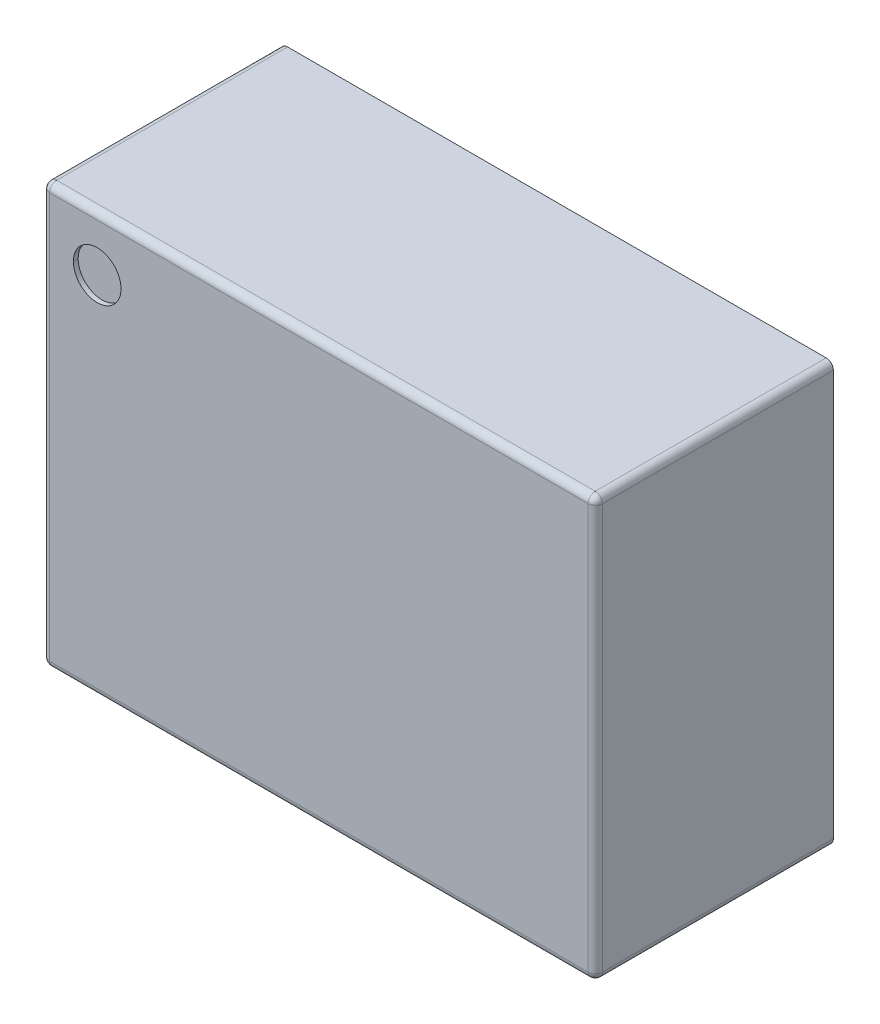
ISO-10303-21;
HEADER;
FILE_DESCRIPTION(('STEP AP214'),'2;1');
FILE_NAME('part.step','',(''),(''),'','','');
FILE_SCHEMA(('AUTOMOTIVE_DESIGN { 1 0 10303 214 1 1 1 1 }'));
ENDSEC;
DATA;
#1=APPLICATION_CONTEXT('core data for automotive mechanical design processes');
#2=APPLICATION_PROTOCOL_DEFINITION('international standard','automotive_design',2000,#1);
#3=PRODUCT_CONTEXT('',#1,'mechanical');
#4=PRODUCT('Part','Part','',(#3));
#5=PRODUCT_RELATED_PRODUCT_CATEGORY('part','',(#4));
#6=PRODUCT_DEFINITION_FORMATION('','',#4);
#7=PRODUCT_DEFINITION_CONTEXT('part definition',#1,'design');
#8=PRODUCT_DEFINITION('design','',#6,#7);
#9=PRODUCT_DEFINITION_SHAPE('','',#8);
#10=(LENGTH_UNIT() NAMED_UNIT(*) SI_UNIT(.MILLI.,.METRE.));
#11=(NAMED_UNIT(*) PLANE_ANGLE_UNIT() SI_UNIT($,.RADIAN.));
#12=(NAMED_UNIT(*) SI_UNIT($,.STERADIAN.) SOLID_ANGLE_UNIT());
#13=UNCERTAINTY_MEASURE_WITH_UNIT(LENGTH_MEASURE(1.E-05),#10,'distance_accuracy_value','');
#14=(GEOMETRIC_REPRESENTATION_CONTEXT(3) GLOBAL_UNCERTAINTY_ASSIGNED_CONTEXT((#13)) GLOBAL_UNIT_ASSIGNED_CONTEXT((#10,
#11,#12)) REPRESENTATION_CONTEXT('',''));
#15=CARTESIAN_POINT('',(0.,0.,0.));
#16=DIRECTION('',(0.,0.,1.));
#17=DIRECTION('',(1.,0.,0.));
#18=AXIS2_PLACEMENT_3D('',#15,#16,#17);
#19=CARTESIAN_POINT('',(-0.4655,0.326,0.68));
#20=DIRECTION('',(0.,0.,1.));
#21=DIRECTION('',(1.,0.,0.));
#22=AXIS2_PLACEMENT_3D('',#19,#20,#21);
#23=CYLINDRICAL_SURFACE('',#22,0.0500000000000001);
#24=CARTESIAN_POINT('',(-0.4655,0.326,0.68));
#25=DIRECTION('',(0.,0.,1.));
#26=DIRECTION('',(1.,0.,0.));
#27=AXIS2_PLACEMENT_3D('',#24,#25,#26);
#28=CIRCLE('',#27,0.0500000000000001);
#29=CARTESIAN_POINT('',(-0.5155,0.326,0.68));
#30=VERTEX_POINT('',#29);
#31=CARTESIAN_POINT('',(-0.4155,0.326,0.68));
#32=VERTEX_POINT('',#31);
#33=EDGE_CURVE('E11',#30,#32,#28,.T.);
#34=ORIENTED_EDGE('',*,*,#33,.F.);
#35=DIRECTION('',(0.,0.,1.));
#36=VECTOR('',#35,1.);
#37=CARTESIAN_POINT('',(-0.5155,0.326,0.68));
#38=LINE('',#37,#36);
#39=CARTESIAN_POINT('',(-0.5155,0.326,0.69));
#40=VERTEX_POINT('',#39);
#41=EDGE_CURVE('E24',#30,#40,#38,.T.);
#42=ORIENTED_EDGE('',*,*,#41,.T.);
#43=CARTESIAN_POINT('',(-0.4655,0.326,0.69));
#44=DIRECTION('',(0.,0.,1.));
#45=DIRECTION('',(1.,0.,0.));
#46=AXIS2_PLACEMENT_3D('',#43,#44,#45);
#47=CIRCLE('',#46,0.0500000000000001);
#48=CARTESIAN_POINT('',(-0.4155,0.326,0.69));
#49=VERTEX_POINT('',#48);
#50=EDGE_CURVE('E206',#40,#49,#47,.T.);
#51=ORIENTED_EDGE('',*,*,#50,.T.);
#52=DIRECTION('',(0.,0.,1.));
#53=VECTOR('',#52,1.);
#54=CARTESIAN_POINT('',(-0.4155,0.326,0.68));
#55=LINE('',#54,#53);
#56=EDGE_CURVE('E37',#32,#49,#55,.T.);
#57=ORIENTED_EDGE('',*,*,#56,.F.);
#58=EDGE_LOOP('',(#34,#42,#51,#57));
#59=FACE_BOUND('',#58,.T.);
#60=ADVANCED_FACE('F17',(#59),#23,.F.);
#61=CARTESIAN_POINT('',(0.5805,0.441,0.69));
#62=DIRECTION('',(-1.,0.,0.));
#63=DIRECTION('',(0.,0.,1.));
#64=AXIS2_PLACEMENT_3D('',#61,#62,#63);
#65=PLANE('',#64);
#66=DIRECTION('',(0.,1.,0.));
#67=VECTOR('',#66,1.);
#68=CARTESIAN_POINT('',(0.5805,0.441,0.19));
#69=LINE('',#68,#67);
#70=CARTESIAN_POINT('',(0.5805,-0.426,0.19));
#71=VERTEX_POINT('',#70);
#72=CARTESIAN_POINT('',(0.5805,0.426,0.19));
#73=VERTEX_POINT('',#72);
#74=EDGE_CURVE('E203',#71,#73,#69,.T.);
#75=ORIENTED_EDGE('',*,*,#74,.T.);
#76=DIRECTION('',(0.,0.,1.));
#77=VECTOR('',#76,1.);
#78=CARTESIAN_POINT('',(0.5805,0.426,0.69));
#79=LINE('',#78,#77);
#80=CARTESIAN_POINT('',(0.5805,0.426,0.675));
#81=VERTEX_POINT('',#80);
#82=EDGE_CURVE('E201',#73,#81,#79,.T.);
#83=ORIENTED_EDGE('',*,*,#82,.T.);
#84=DIRECTION('',(0.,-1.,0.));
#85=VECTOR('',#84,1.);
#86=CARTESIAN_POINT('',(0.5805,-0.441,0.675));
#87=LINE('',#86,#85);
#88=CARTESIAN_POINT('',(0.5805,-0.426,0.675));
#89=VERTEX_POINT('',#88);
#90=EDGE_CURVE('E139',#81,#89,#87,.T.);
#91=ORIENTED_EDGE('',*,*,#90,.T.);
#92=DIRECTION('',(0.,0.,-1.));
#93=VECTOR('',#92,1.);
#94=CARTESIAN_POINT('',(0.5805,-0.426,0.69));
#95=LINE('',#94,#93);
#96=EDGE_CURVE('E197',#89,#71,#95,.T.);
#97=ORIENTED_EDGE('',*,*,#96,.T.);
#98=EDGE_LOOP('',(#75,#83,#91,#97));
#99=FACE_BOUND('',#98,.T.);
#100=ADVANCED_FACE('F227',(#99),#65,.F.);
#101=CARTESIAN_POINT('',(-0.5805,0.441,0.69));
#102=DIRECTION('',(0.,-1.,0.));
#103=DIRECTION('',(0.,0.,-1.));
#104=AXIS2_PLACEMENT_3D('',#101,#102,#103);
#105=PLANE('',#104);
#106=DIRECTION('',(-1.,0.,0.));
#107=VECTOR('',#106,1.);
#108=CARTESIAN_POINT('',(-0.5805,0.441,0.19));
#109=LINE('',#108,#107);
#110=CARTESIAN_POINT('',(0.5655,0.441,0.19));
#111=VERTEX_POINT('',#110);
#112=CARTESIAN_POINT('',(-0.5655,0.441,0.19));
#113=VERTEX_POINT('',#112);
#114=EDGE_CURVE('E195',#111,#113,#109,.T.);
#115=ORIENTED_EDGE('',*,*,#114,.T.);
#116=DIRECTION('',(0.,0.,1.));
#117=VECTOR('',#116,1.);
#118=CARTESIAN_POINT('',(-0.5655,0.441,0.69));
#119=LINE('',#118,#117);
#120=CARTESIAN_POINT('',(-0.5655,0.441,0.675));
#121=VERTEX_POINT('',#120);
#122=EDGE_CURVE('E193',#113,#121,#119,.T.);
#123=ORIENTED_EDGE('',*,*,#122,.T.);
#124=DIRECTION('',(1.,0.,0.));
#125=VECTOR('',#124,1.);
#126=CARTESIAN_POINT('',(0.5805,0.441,0.675));
#127=LINE('',#126,#125);
#128=CARTESIAN_POINT('',(0.5655,0.441,0.675));
#129=VERTEX_POINT('',#128);
#130=EDGE_CURVE('E191',#121,#129,#127,.T.);
#131=ORIENTED_EDGE('',*,*,#130,.T.);
#132=DIRECTION('',(0.,0.,-1.));
#133=VECTOR('',#132,1.);
#134=CARTESIAN_POINT('',(0.5655,0.441,0.69));
#135=LINE('',#134,#133);
#136=EDGE_CURVE('E188',#129,#111,#135,.T.);
#137=ORIENTED_EDGE('',*,*,#136,.T.);
#138=EDGE_LOOP('',(#115,#123,#131,#137));
#139=FACE_BOUND('',#138,.T.);
#140=ADVANCED_FACE('F231',(#139),#105,.F.);
#141=CARTESIAN_POINT('',(-0.5805,0.441,0.69));
#142=DIRECTION('',(1.,0.,0.));
#143=DIRECTION('',(0.,0.,-1.));
#144=AXIS2_PLACEMENT_3D('',#141,#142,#143);
#145=PLANE('',#144);
#146=DIRECTION('',(0.,1.,0.));
#147=VECTOR('',#146,1.);
#148=CARTESIAN_POINT('',(-0.5805,0.441,0.675));
#149=LINE('',#148,#147);
#150=CARTESIAN_POINT('',(-0.5805,-0.426,0.675));
#151=VERTEX_POINT('',#150);
#152=CARTESIAN_POINT('',(-0.5805,0.426,0.675));
#153=VERTEX_POINT('',#152);
#154=EDGE_CURVE('E186',#151,#153,#149,.T.);
#155=ORIENTED_EDGE('',*,*,#154,.T.);
#156=DIRECTION('',(0.,0.,-1.));
#157=VECTOR('',#156,1.);
#158=CARTESIAN_POINT('',(-0.5805,0.426,0.69));
#159=LINE('',#158,#157);
#160=CARTESIAN_POINT('',(-0.5805,0.426,0.19));
#161=VERTEX_POINT('',#160);
#162=EDGE_CURVE('E184',#153,#161,#159,.T.);
#163=ORIENTED_EDGE('',*,*,#162,.T.);
#164=DIRECTION('',(0.,-1.,0.));
#165=VECTOR('',#164,1.);
#166=CARTESIAN_POINT('',(-0.5805,0.441,0.19));
#167=LINE('',#166,#165);
#168=CARTESIAN_POINT('',(-0.5805,-0.426,0.19));
#169=VERTEX_POINT('',#168);
#170=EDGE_CURVE('E182',#161,#169,#167,.T.);
#171=ORIENTED_EDGE('',*,*,#170,.T.);
#172=DIRECTION('',(0.,0.,1.));
#173=VECTOR('',#172,1.);
#174=CARTESIAN_POINT('',(-0.5805,-0.426,0.69));
#175=LINE('',#174,#173);
#176=EDGE_CURVE('E179',#169,#151,#175,.T.);
#177=ORIENTED_EDGE('',*,*,#176,.T.);
#178=EDGE_LOOP('',(#155,#163,#171,#177));
#179=FACE_BOUND('',#178,.T.);
#180=ADVANCED_FACE('F223',(#179),#145,.F.);
#181=CARTESIAN_POINT('',(-0.5805,-0.441,0.69));
#182=DIRECTION('',(0.,1.,0.));
#183=DIRECTION('',(0.,0.,1.));
#184=AXIS2_PLACEMENT_3D('',#181,#182,#183);
#185=PLANE('',#184);
#186=DIRECTION('',(1.,0.,0.));
#187=VECTOR('',#186,1.);
#188=CARTESIAN_POINT('',(-0.5805,-0.441,0.19));
#189=LINE('',#188,#187);
#190=CARTESIAN_POINT('',(-0.5655,-0.441,0.19));
#191=VERTEX_POINT('',#190);
#192=CARTESIAN_POINT('',(0.5655,-0.441,0.19));
#193=VERTEX_POINT('',#192);
#194=EDGE_CURVE('E177',#191,#193,#189,.T.);
#195=ORIENTED_EDGE('',*,*,#194,.T.);
#196=DIRECTION('',(0.,0.,1.));
#197=VECTOR('',#196,1.);
#198=CARTESIAN_POINT('',(0.5655,-0.441,0.69));
#199=LINE('',#198,#197);
#200=CARTESIAN_POINT('',(0.5655,-0.441,0.675));
#201=VERTEX_POINT('',#200);
#202=EDGE_CURVE('E175',#193,#201,#199,.T.);
#203=ORIENTED_EDGE('',*,*,#202,.T.);
#204=DIRECTION('',(-1.,0.,0.));
#205=VECTOR('',#204,1.);
#206=CARTESIAN_POINT('',(-0.5805,-0.441,0.675));
#207=LINE('',#206,#205);
#208=CARTESIAN_POINT('',(-0.5655,-0.441,0.675));
#209=VERTEX_POINT('',#208);
#210=EDGE_CURVE('E173',#201,#209,#207,.T.);
#211=ORIENTED_EDGE('',*,*,#210,.T.);
#212=DIRECTION('',(0.,0.,-1.));
#213=VECTOR('',#212,1.);
#214=CARTESIAN_POINT('',(-0.5655,-0.441,0.69));
#215=LINE('',#214,#213);
#216=EDGE_CURVE('E170',#209,#191,#215,.T.);
#217=ORIENTED_EDGE('',*,*,#216,.T.);
#218=EDGE_LOOP('',(#195,#203,#211,#217));
#219=FACE_BOUND('',#218,.T.);
#220=ADVANCED_FACE('F213',(#219),#185,.F.);
#221=CARTESIAN_POINT('',(0.,0.,0.69));
#222=DIRECTION('',(0.,0.,1.));
#223=DIRECTION('',(1.,0.,0.));
#224=AXIS2_PLACEMENT_3D('',#221,#222,#223);
#225=PLANE('',#224);
#226=CARTESIAN_POINT('',(-0.4655,0.326,0.69));
#227=DIRECTION('',(0.,0.,1.));
#228=DIRECTION('',(1.,0.,0.));
#229=AXIS2_PLACEMENT_3D('',#226,#227,#228);
#230=CIRCLE('',#229,0.0500000000000001);
#231=EDGE_CURVE('E168',#49,#40,#230,.T.);
#232=ORIENTED_EDGE('',*,*,#231,.F.);
#233=ORIENTED_EDGE('',*,*,#50,.F.);
#234=EDGE_LOOP('',(#232,#233));
#235=FACE_BOUND('',#234,.T.);
#236=DIRECTION('',(0.,-1.,0.));
#237=VECTOR('',#236,1.);
#238=CARTESIAN_POINT('',(-0.5655,-0.441,0.69));
#239=LINE('',#238,#237);
#240=CARTESIAN_POINT('',(-0.5655,0.426,0.69));
#241=VERTEX_POINT('',#240);
#242=CARTESIAN_POINT('',(-0.5655,-0.426,0.69));
#243=VERTEX_POINT('',#242);
#244=EDGE_CURVE('E166',#241,#243,#239,.T.);
#245=ORIENTED_EDGE('',*,*,#244,.T.);
#246=DIRECTION('',(1.,0.,0.));
#247=VECTOR('',#246,1.);
#248=CARTESIAN_POINT('',(0.5805,-0.426,0.69));
#249=LINE('',#248,#247);
#250=CARTESIAN_POINT('',(0.5655,-0.426,0.69));
#251=VERTEX_POINT('',#250);
#252=EDGE_CURVE('E111',#243,#251,#249,.T.);
#253=ORIENTED_EDGE('',*,*,#252,.T.);
#254=DIRECTION('',(0.,1.,0.));
#255=VECTOR('',#254,1.);
#256=CARTESIAN_POINT('',(0.5655,0.441,0.69));
#257=LINE('',#256,#255);
#258=CARTESIAN_POINT('',(0.5655,0.426,0.69));
#259=VERTEX_POINT('',#258);
#260=EDGE_CURVE('E105',#251,#259,#257,.T.);
#261=ORIENTED_EDGE('',*,*,#260,.T.);
#262=DIRECTION('',(-1.,0.,0.));
#263=VECTOR('',#262,1.);
#264=CARTESIAN_POINT('',(-0.5805,0.426,0.69));
#265=LINE('',#264,#263);
#266=EDGE_CURVE('E108',#259,#241,#265,.T.);
#267=ORIENTED_EDGE('',*,*,#266,.T.);
#268=EDGE_LOOP('',(#245,#253,#261,#267));
#269=FACE_BOUND('',#268,.T.);
#270=ADVANCED_FACE('F107',(#235,#269),#225,.T.);
#271=CARTESIAN_POINT('',(0.,0.,0.19));
#272=DIRECTION('',(0.,0.,1.));
#273=DIRECTION('',(1.,0.,0.));
#274=AXIS2_PLACEMENT_3D('',#271,#272,#273);
#275=PLANE('',#274);
#276=ORIENTED_EDGE('',*,*,#170,.F.);
#277=CARTESIAN_POINT('',(-0.5655,0.426,0.19));
#278=DIRECTION('',(0.,0.,-1.));
#279=DIRECTION('',(1.,0.,0.));
#280=AXIS2_PLACEMENT_3D('',#277,#278,#279);
#281=CIRCLE('',#280,0.015);
#282=EDGE_CURVE('E127',#161,#113,#281,.T.);
#283=ORIENTED_EDGE('',*,*,#282,.T.);
#284=ORIENTED_EDGE('',*,*,#114,.F.);
#285=CARTESIAN_POINT('',(0.5655,0.426,0.19));
#286=DIRECTION('',(0.,0.,-1.));
#287=DIRECTION('',(1.,0.,0.));
#288=AXIS2_PLACEMENT_3D('',#285,#286,#287);
#289=CIRCLE('',#288,0.015);
#290=EDGE_CURVE('E160',#111,#73,#289,.T.);
#291=ORIENTED_EDGE('',*,*,#290,.T.);
#292=ORIENTED_EDGE('',*,*,#74,.F.);
#293=CARTESIAN_POINT('',(0.5655,-0.426,0.19));
#294=DIRECTION('',(0.,0.,-1.));
#295=DIRECTION('',(1.,0.,0.));
#296=AXIS2_PLACEMENT_3D('',#293,#294,#295);
#297=CIRCLE('',#296,0.015);
#298=EDGE_CURVE('E157',#71,#193,#297,.T.);
#299=ORIENTED_EDGE('',*,*,#298,.T.);
#300=ORIENTED_EDGE('',*,*,#194,.F.);
#301=CARTESIAN_POINT('',(-0.5655,-0.426,0.19));
#302=DIRECTION('',(0.,0.,-1.));
#303=DIRECTION('',(1.,0.,0.));
#304=AXIS2_PLACEMENT_3D('',#301,#302,#303);
#305=CIRCLE('',#304,0.015);
#306=EDGE_CURVE('E154',#191,#169,#305,.T.);
#307=ORIENTED_EDGE('',*,*,#306,.T.);
#308=EDGE_LOOP('',(#276,#283,#284,#291,#292,#299,#300,#307));
#309=FACE_BOUND('',#308,.T.);
#310=ADVANCED_FACE('F212',(#309),#275,.F.);
#311=CARTESIAN_POINT('',(-0.5655,0.426,0.69));
#312=DIRECTION('',(0.,0.,-1.));
#313=DIRECTION('',(-1.,0.,0.));
#314=AXIS2_PLACEMENT_3D('',#311,#312,#313);
#315=CYLINDRICAL_SURFACE('',#314,0.015);
#316=ORIENTED_EDGE('',*,*,#282,.F.);
#317=ORIENTED_EDGE('',*,*,#162,.F.);
#318=CARTESIAN_POINT('',(-0.5655,0.426,0.675));
#319=DIRECTION('',(0.,0.,1.));
#320=DIRECTION('',(1.,0.,0.));
#321=AXIS2_PLACEMENT_3D('',#318,#319,#320);
#322=CIRCLE('',#321,0.015);
#323=EDGE_CURVE('E135',#121,#153,#322,.T.);
#324=ORIENTED_EDGE('',*,*,#323,.F.);
#325=ORIENTED_EDGE('',*,*,#122,.F.);
#326=EDGE_LOOP('',(#316,#317,#324,#325));
#327=FACE_BOUND('',#326,.T.);
#328=ADVANCED_FACE('F220',(#327),#315,.T.);
#329=CARTESIAN_POINT('',(0.,0.426,0.675));
#330=DIRECTION('',(1.,0.,0.));
#331=DIRECTION('',(0.,0.,-1.));
#332=AXIS2_PLACEMENT_3D('',#329,#330,#331);
#333=CYLINDRICAL_SURFACE('',#332,0.015);
#334=CARTESIAN_POINT('',(0.5655,0.426,0.675));
#335=DIRECTION('',(1.,0.,0.));
#336=DIRECTION('',(0.,0.,-1.));
#337=AXIS2_PLACEMENT_3D('',#334,#335,#336);
#338=CIRCLE('',#337,0.015);
#339=EDGE_CURVE('E122',#129,#259,#338,.T.);
#340=ORIENTED_EDGE('',*,*,#339,.F.);
#341=ORIENTED_EDGE('',*,*,#130,.F.);
#342=CARTESIAN_POINT('',(-0.5655,0.426,0.675));
#343=DIRECTION('',(-1.,0.,0.));
#344=DIRECTION('',(0.,0.,1.));
#345=AXIS2_PLACEMENT_3D('',#342,#343,#344);
#346=CIRCLE('',#345,0.015);
#347=EDGE_CURVE('E125',#241,#121,#346,.T.);
#348=ORIENTED_EDGE('',*,*,#347,.F.);
#349=ORIENTED_EDGE('',*,*,#266,.F.);
#350=EDGE_LOOP('',(#340,#341,#348,#349));
#351=FACE_BOUND('',#350,.T.);
#352=ADVANCED_FACE('F120',(#351),#333,.T.);
#353=CARTESIAN_POINT('',(0.5655,0.426,0.69));
#354=DIRECTION('',(0.,0.,-1.));
#355=DIRECTION('',(-1.,0.,0.));
#356=AXIS2_PLACEMENT_3D('',#353,#354,#355);
#357=CYLINDRICAL_SURFACE('',#356,0.015);
#358=ORIENTED_EDGE('',*,*,#290,.F.);
#359=ORIENTED_EDGE('',*,*,#136,.F.);
#360=CARTESIAN_POINT('',(0.5655,0.426,0.675));
#361=DIRECTION('',(0.,0.,1.));
#362=DIRECTION('',(1.,0.,0.));
#363=AXIS2_PLACEMENT_3D('',#360,#361,#362);
#364=CIRCLE('',#363,0.015);
#365=EDGE_CURVE('E134',#81,#129,#364,.T.);
#366=ORIENTED_EDGE('',*,*,#365,.F.);
#367=ORIENTED_EDGE('',*,*,#82,.F.);
#368=EDGE_LOOP('',(#358,#359,#366,#367));
#369=FACE_BOUND('',#368,.T.);
#370=ADVANCED_FACE('F313',(#369),#357,.T.);
#371=CARTESIAN_POINT('',(-0.5655,0.426,0.675));
#372=DIRECTION('',(0.,1.,0.));
#373=DIRECTION('',(1.,0.,0.));
#374=AXIS2_PLACEMENT_3D('',#371,#372,#373);
#375=SPHERICAL_SURFACE('',#374,0.015);
#376=ORIENTED_EDGE('',*,*,#347,.T.);
#377=ORIENTED_EDGE('',*,*,#323,.T.);
#378=CARTESIAN_POINT('',(-0.5655,0.426,0.675));
#379=DIRECTION('',(0.,-1.,0.));
#380=DIRECTION('',(0.,0.,1.));
#381=AXIS2_PLACEMENT_3D('',#378,#379,#380);
#382=CIRCLE('',#381,0.015);
#383=EDGE_CURVE('E140',#241,#153,#382,.T.);
#384=ORIENTED_EDGE('',*,*,#383,.F.);
#385=EDGE_LOOP('',(#376,#377,#384));
#386=FACE_BOUND('',#385,.T.);
#387=ADVANCED_FACE('F254',(#386),#375,.T.);
#388=CARTESIAN_POINT('',(0.5655,0.426,0.675));
#389=DIRECTION('',(0.,1.,0.));
#390=DIRECTION('',(1.,0.,0.));
#391=AXIS2_PLACEMENT_3D('',#388,#389,#390);
#392=SPHERICAL_SURFACE('',#391,0.015);
#393=ORIENTED_EDGE('',*,*,#365,.T.);
#394=ORIENTED_EDGE('',*,*,#339,.T.);
#395=CARTESIAN_POINT('',(0.5655,0.426,0.675));
#396=DIRECTION('',(0.,-1.,0.));
#397=DIRECTION('',(0.,0.,1.));
#398=AXIS2_PLACEMENT_3D('',#395,#396,#397);
#399=CIRCLE('',#398,0.015);
#400=EDGE_CURVE('E132',#81,#259,#399,.T.);
#401=ORIENTED_EDGE('',*,*,#400,.F.);
#402=EDGE_LOOP('',(#393,#394,#401));
#403=FACE_BOUND('',#402,.T.);
#404=ADVANCED_FACE('F131',(#403),#392,.T.);
#405=CARTESIAN_POINT('',(-0.5655,-0.426,0.69));
#406=DIRECTION('',(0.,0.,-1.));
#407=DIRECTION('',(-1.,0.,0.));
#408=AXIS2_PLACEMENT_3D('',#405,#406,#407);
#409=CYLINDRICAL_SURFACE('',#408,0.015);
#410=ORIENTED_EDGE('',*,*,#306,.F.);
#411=ORIENTED_EDGE('',*,*,#216,.F.);
#412=CARTESIAN_POINT('',(-0.5655,-0.426,0.675));
#413=DIRECTION('',(0.,0.,1.));
#414=DIRECTION('',(1.,0.,0.));
#415=AXIS2_PLACEMENT_3D('',#412,#413,#414);
#416=CIRCLE('',#415,0.015);
#417=EDGE_CURVE('E141',#151,#209,#416,.T.);
#418=ORIENTED_EDGE('',*,*,#417,.F.);
#419=ORIENTED_EDGE('',*,*,#176,.F.);
#420=EDGE_LOOP('',(#410,#411,#418,#419));
#421=FACE_BOUND('',#420,.T.);
#422=ADVANCED_FACE('F282',(#421),#409,.T.);
#423=CARTESIAN_POINT('',(-0.5655,0.,0.675));
#424=DIRECTION('',(0.,1.,0.));
#425=DIRECTION('',(0.,0.,1.));
#426=AXIS2_PLACEMENT_3D('',#423,#424,#425);
#427=CYLINDRICAL_SURFACE('',#426,0.015);
#428=ORIENTED_EDGE('',*,*,#383,.T.);
#429=ORIENTED_EDGE('',*,*,#154,.F.);
#430=CARTESIAN_POINT('',(-0.5655,-0.426,0.675));
#431=DIRECTION('',(0.,-1.,0.));
#432=DIRECTION('',(0.,0.,-1.));
#433=AXIS2_PLACEMENT_3D('',#430,#431,#432);
#434=CIRCLE('',#433,0.015);
#435=EDGE_CURVE('E146',#243,#151,#434,.T.);
#436=ORIENTED_EDGE('',*,*,#435,.F.);
#437=ORIENTED_EDGE('',*,*,#244,.F.);
#438=EDGE_LOOP('',(#428,#429,#436,#437));
#439=FACE_BOUND('',#438,.T.);
#440=ADVANCED_FACE('F255',(#439),#427,.T.);
#441=CARTESIAN_POINT('',(0.5655,0.,0.675));
#442=DIRECTION('',(0.,-1.,0.));
#443=DIRECTION('',(0.,0.,-1.));
#444=AXIS2_PLACEMENT_3D('',#441,#442,#443);
#445=CYLINDRICAL_SURFACE('',#444,0.015);
#446=ORIENTED_EDGE('',*,*,#400,.T.);
#447=ORIENTED_EDGE('',*,*,#260,.F.);
#448=CARTESIAN_POINT('',(0.5655,-0.426,0.675));
#449=DIRECTION('',(0.,-1.,0.));
#450=DIRECTION('',(0.,0.,-1.));
#451=AXIS2_PLACEMENT_3D('',#448,#449,#450);
#452=CIRCLE('',#451,0.015);
#453=EDGE_CURVE('E276',#89,#251,#452,.T.);
#454=ORIENTED_EDGE('',*,*,#453,.F.);
#455=ORIENTED_EDGE('',*,*,#90,.F.);
#456=EDGE_LOOP('',(#446,#447,#454,#455));
#457=FACE_BOUND('',#456,.T.);
#458=ADVANCED_FACE('F138',(#457),#445,.T.);
#459=CARTESIAN_POINT('',(0.5655,-0.426,0.69));
#460=DIRECTION('',(0.,0.,-1.));
#461=DIRECTION('',(-1.,0.,0.));
#462=AXIS2_PLACEMENT_3D('',#459,#460,#461);
#463=CYLINDRICAL_SURFACE('',#462,0.015);
#464=ORIENTED_EDGE('',*,*,#298,.F.);
#465=ORIENTED_EDGE('',*,*,#96,.F.);
#466=CARTESIAN_POINT('',(0.5655,-0.426,0.675));
#467=DIRECTION('',(0.,0.,1.));
#468=DIRECTION('',(1.,0.,0.));
#469=AXIS2_PLACEMENT_3D('',#466,#467,#468);
#470=CIRCLE('',#469,0.015);
#471=EDGE_CURVE('E271',#201,#89,#470,.T.);
#472=ORIENTED_EDGE('',*,*,#471,.F.);
#473=ORIENTED_EDGE('',*,*,#202,.F.);
#474=EDGE_LOOP('',(#464,#465,#472,#473));
#475=FACE_BOUND('',#474,.T.);
#476=ADVANCED_FACE('F286',(#475),#463,.T.);
#477=CARTESIAN_POINT('',(-0.5655,-0.426,0.675));
#478=DIRECTION('',(0.,1.,0.));
#479=DIRECTION('',(1.,0.,0.));
#480=AXIS2_PLACEMENT_3D('',#477,#478,#479);
#481=SPHERICAL_SURFACE('',#480,0.015);
#482=ORIENTED_EDGE('',*,*,#435,.T.);
#483=ORIENTED_EDGE('',*,*,#417,.T.);
#484=CARTESIAN_POINT('',(-0.5655,-0.426,0.675));
#485=DIRECTION('',(1.,0.,0.));
#486=DIRECTION('',(0.,0.,1.));
#487=AXIS2_PLACEMENT_3D('',#484,#485,#486);
#488=CIRCLE('',#487,0.015);
#489=EDGE_CURVE('E263',#243,#209,#488,.T.);
#490=ORIENTED_EDGE('',*,*,#489,.F.);
#491=EDGE_LOOP('',(#482,#483,#490));
#492=FACE_BOUND('',#491,.T.);
#493=ADVANCED_FACE('F278',(#492),#481,.T.);
#494=CARTESIAN_POINT('',(0.5655,-0.426,0.675));
#495=DIRECTION('',(0.,1.,0.));
#496=DIRECTION('',(1.,0.,0.));
#497=AXIS2_PLACEMENT_3D('',#494,#495,#496);
#498=SPHERICAL_SURFACE('',#497,0.015);
#499=ORIENTED_EDGE('',*,*,#471,.T.);
#500=ORIENTED_EDGE('',*,*,#453,.T.);
#501=CARTESIAN_POINT('',(0.5655,-0.426,0.675));
#502=DIRECTION('',(-1.,0.,0.));
#503=DIRECTION('',(0.,0.,-1.));
#504=AXIS2_PLACEMENT_3D('',#501,#502,#503);
#505=CIRCLE('',#504,0.015);
#506=EDGE_CURVE('E265',#201,#251,#505,.T.);
#507=ORIENTED_EDGE('',*,*,#506,.F.);
#508=EDGE_LOOP('',(#499,#500,#507));
#509=FACE_BOUND('',#508,.T.);
#510=ADVANCED_FACE('F290',(#509),#498,.T.);
#511=CARTESIAN_POINT('',(0.,-0.426,0.675));
#512=DIRECTION('',(-1.,0.,0.));
#513=DIRECTION('',(0.,0.,1.));
#514=AXIS2_PLACEMENT_3D('',#511,#512,#513);
#515=CYLINDRICAL_SURFACE('',#514,0.015);
#516=ORIENTED_EDGE('',*,*,#489,.T.);
#517=ORIENTED_EDGE('',*,*,#210,.F.);
#518=ORIENTED_EDGE('',*,*,#506,.T.);
#519=ORIENTED_EDGE('',*,*,#252,.F.);
#520=EDGE_LOOP('',(#516,#517,#518,#519));
#521=FACE_BOUND('',#520,.T.);
#522=ADVANCED_FACE('F261',(#521),#515,.T.);
#523=CARTESIAN_POINT('',(-0.4655,0.326,0.68));
#524=DIRECTION('',(0.,0.,1.));
#525=DIRECTION('',(1.,0.,0.));
#526=AXIS2_PLACEMENT_3D('',#523,#524,#525);
#527=CYLINDRICAL_SURFACE('',#526,0.0500000000000001);
#528=ORIENTED_EDGE('',*,*,#41,.F.);
#529=CARTESIAN_POINT('',(-0.4655,0.326,0.68));
#530=DIRECTION('',(0.,0.,1.));
#531=DIRECTION('',(1.,0.,0.));
#532=AXIS2_PLACEMENT_3D('',#529,#530,#531);
#533=CIRCLE('',#532,0.0500000000000001);
#534=EDGE_CURVE('E269',#32,#30,#533,.T.);
#535=ORIENTED_EDGE('',*,*,#534,.F.);
#536=ORIENTED_EDGE('',*,*,#56,.T.);
#537=ORIENTED_EDGE('',*,*,#231,.T.);
#538=EDGE_LOOP('',(#528,#535,#536,#537));
#539=FACE_BOUND('',#538,.T.);
#540=ADVANCED_FACE('F209',(#539),#527,.F.);
#541=CARTESIAN_POINT('',(-0.4655,0.326,0.68));
#542=DIRECTION('',(0.,0.,1.));
#543=DIRECTION('',(1.,0.,0.));
#544=AXIS2_PLACEMENT_3D('',#541,#542,#543);
#545=PLANE('',#544);
#546=ORIENTED_EDGE('',*,*,#534,.T.);
#547=ORIENTED_EDGE('',*,*,#33,.T.);
#548=EDGE_LOOP('',(#546,#547));
#549=FACE_BOUND('',#548,.T.);
#550=ADVANCED_FACE('F384',(#549),#545,.T.);
#551=CLOSED_SHELL('',(#60,#100,#140,#180,#220,#270,#310,#328,#352,#370,#387,#404,#422,#440,#458,
#476,#493,#510,#522,#540,#550));
#552=MANIFOLD_SOLID_BREP('B1',#551);
#553=ADVANCED_BREP_SHAPE_REPRESENTATION('',(#18,#552),#14);
#554=SHAPE_DEFINITION_REPRESENTATION(#9,#553);
ENDSEC;
END-ISO-10303-21;
